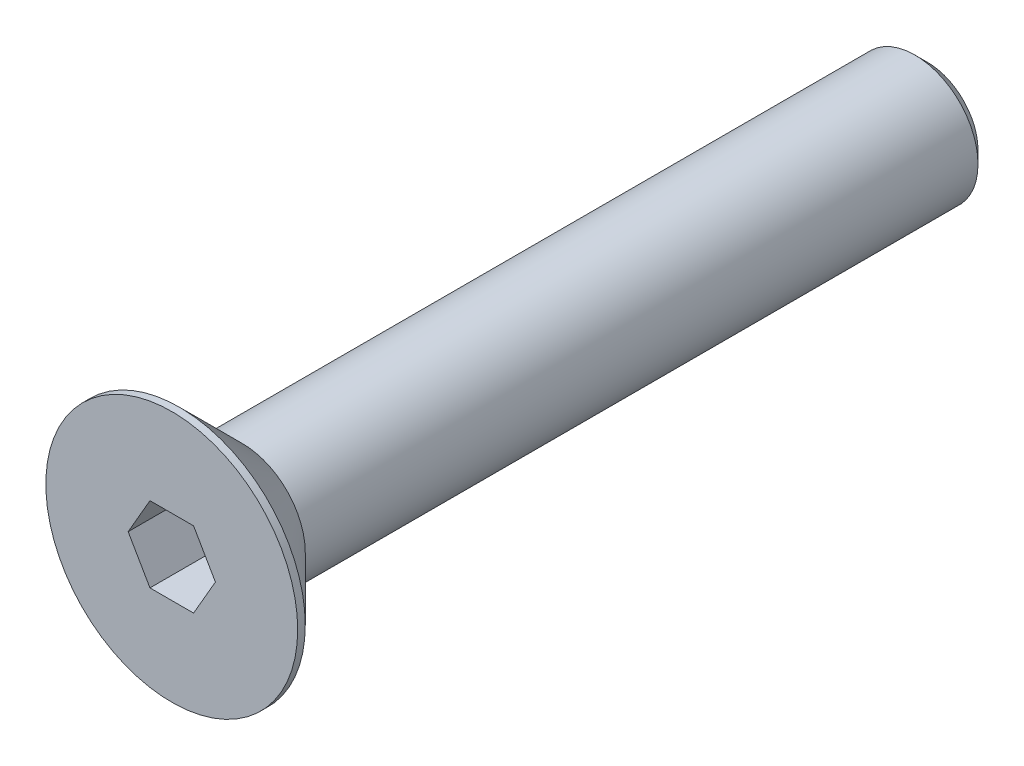
ISO-10303-21;
HEADER;
FILE_DESCRIPTION(('STEP AP214'),'2;1');
FILE_NAME('part.step','',(''),(''),'','','');
FILE_SCHEMA(('AUTOMOTIVE_DESIGN { 1 0 10303 214 1 1 1 1 }'));
ENDSEC;
DATA;
#1=APPLICATION_CONTEXT('core data for automotive mechanical design processes');
#2=APPLICATION_PROTOCOL_DEFINITION('international standard','automotive_design',2000,#1);
#3=PRODUCT_CONTEXT('',#1,'mechanical');
#4=PRODUCT('Part','Part','',(#3));
#5=PRODUCT_RELATED_PRODUCT_CATEGORY('part','',(#4));
#6=PRODUCT_DEFINITION_FORMATION('','',#4);
#7=PRODUCT_DEFINITION_CONTEXT('part definition',#1,'design');
#8=PRODUCT_DEFINITION('design','',#6,#7);
#9=PRODUCT_DEFINITION_SHAPE('','',#8);
#10=(LENGTH_UNIT() NAMED_UNIT(*) SI_UNIT(.MILLI.,.METRE.));
#11=(NAMED_UNIT(*) PLANE_ANGLE_UNIT() SI_UNIT($,.RADIAN.));
#12=(NAMED_UNIT(*) SI_UNIT($,.STERADIAN.) SOLID_ANGLE_UNIT());
#13=UNCERTAINTY_MEASURE_WITH_UNIT(LENGTH_MEASURE(1.E-05),#10,'distance_accuracy_value','');
#14=(GEOMETRIC_REPRESENTATION_CONTEXT(3) GLOBAL_UNCERTAINTY_ASSIGNED_CONTEXT((#13)) GLOBAL_UNIT_ASSIGNED_CONTEXT((#10,
#11,#12)) REPRESENTATION_CONTEXT('',''));
#15=CARTESIAN_POINT('',(0.,0.,0.));
#16=DIRECTION('',(0.,0.,1.));
#17=DIRECTION('',(1.,0.,0.));
#18=AXIS2_PLACEMENT_3D('',#15,#16,#17);
#19=CARTESIAN_POINT('',(0.,0.,2.8));
#20=DIRECTION('',(0.,0.,1.));
#21=DIRECTION('',(-1.,0.,0.));
#22=AXIS2_PLACEMENT_3D('',#19,#20,#21);
#23=PLANE('',#22);
#24=CARTESIAN_POINT('',(0.,0.,2.8));
#25=DIRECTION('',(0.,0.,1.));
#26=DIRECTION('',(1.,0.,0.));
#27=AXIS2_PLACEMENT_3D('',#24,#25,#26);
#28=CIRCLE('',#27,5.);
#29=CARTESIAN_POINT('',(5.,0.,2.8));
#30=VERTEX_POINT('',#29);
#31=EDGE_CURVE('E11',#30,#30,#28,.T.);
#32=ORIENTED_EDGE('',*,*,#31,.T.);
#33=EDGE_LOOP('',(#32));
#34=FACE_BOUND('',#33,.T.);
#35=DIRECTION('',(-1.,0.,0.));
#36=VECTOR('',#35,1.);
#37=CARTESIAN_POINT('',(0.216506350949999,-1.5,2.8));
#38=LINE('',#37,#36);
#39=CARTESIAN_POINT('',(0.8660254038,-1.5,2.8));
#40=VERTEX_POINT('',#39);
#41=CARTESIAN_POINT('',(-0.8660254038,-1.5,2.8));
#42=VERTEX_POINT('',#41);
#43=EDGE_CURVE('E76',#40,#42,#38,.T.);
#44=ORIENTED_EDGE('',*,*,#43,.T.);
#45=DIRECTION('',(-0.500000000006738,0.866025403780548,0.));
#46=VECTOR('',#45,1.);
#47=CARTESIAN_POINT('',(-1.29903810569416,-0.750000000010107,2.8));
#48=LINE('',#47,#46);
#49=CARTESIAN_POINT('',(-1.7320508076,0.,2.8));
#50=VERTEX_POINT('',#49);
#51=EDGE_CURVE('E110',#42,#50,#48,.T.);
#52=ORIENTED_EDGE('',*,*,#51,.T.);
#53=DIRECTION('',(0.500000000006738,0.866025403780548,0.));
#54=VECTOR('',#53,1.);
#55=CARTESIAN_POINT('',(-1.29903810569416,0.750000000010108,2.8));
#56=LINE('',#55,#54);
#57=CARTESIAN_POINT('',(-0.8660254038,1.5,2.8));
#58=VERTEX_POINT('',#57);
#59=EDGE_CURVE('E120',#50,#58,#56,.T.);
#60=ORIENTED_EDGE('',*,*,#59,.T.);
#61=DIRECTION('',(1.,0.,0.));
#62=VECTOR('',#61,1.);
#63=CARTESIAN_POINT('',(0.,1.5,2.8));
#64=LINE('',#63,#62);
#65=CARTESIAN_POINT('',(0.8660254038,1.5,2.8));
#66=VERTEX_POINT('',#65);
#67=EDGE_CURVE('E114',#58,#66,#64,.T.);
#68=ORIENTED_EDGE('',*,*,#67,.T.);
#69=DIRECTION('',(0.500000000006738,-0.866025403780548,0.));
#70=VECTOR('',#69,1.);
#71=CARTESIAN_POINT('',(1.29903810569416,0.750000000010107,2.8));
#72=LINE('',#71,#70);
#73=CARTESIAN_POINT('',(1.7320508076,0.,2.8));
#74=VERTEX_POINT('',#73);
#75=EDGE_CURVE('E97',#66,#74,#72,.T.);
#76=ORIENTED_EDGE('',*,*,#75,.T.);
#77=DIRECTION('',(-0.500000000006738,-0.866025403780548,0.));
#78=VECTOR('',#77,1.);
#79=CARTESIAN_POINT('',(1.29903810569416,-0.750000000010108,2.8));
#80=LINE('',#79,#78);
#81=EDGE_CURVE('E91',#74,#40,#80,.T.);
#82=ORIENTED_EDGE('',*,*,#81,.T.);
#83=EDGE_LOOP('',(#44,#52,#60,#68,#76,#82));
#84=FACE_BOUND('',#83,.T.);
#85=ADVANCED_FACE('F16',(#34,#84),#23,.T.);
#86=CARTESIAN_POINT('',(0.,0.,1.4));
#87=DIRECTION('',(0.,0.,1.));
#88=DIRECTION('',(1.,0.,0.));
#89=AXIS2_PLACEMENT_3D('',#86,#87,#88);
#90=CYLINDRICAL_SURFACE('',#89,5.);
#91=ORIENTED_EDGE('',*,*,#31,.F.);
#92=EDGE_LOOP('',(#91));
#93=FACE_BOUND('',#92,.T.);
#94=CARTESIAN_POINT('',(0.,0.,2.5));
#95=DIRECTION('',(0.,0.,1.));
#96=DIRECTION('',(1.,0.,0.));
#97=AXIS2_PLACEMENT_3D('',#94,#95,#96);
#98=CIRCLE('',#97,5.);
#99=CARTESIAN_POINT('',(5.,0.,2.5));
#100=VERTEX_POINT('',#99);
#101=EDGE_CURVE('E24',#100,#100,#98,.T.);
#102=ORIENTED_EDGE('',*,*,#101,.T.);
#103=EDGE_LOOP('',(#102));
#104=FACE_BOUND('',#103,.T.);
#105=ADVANCED_FACE('F166',(#93,#104),#90,.T.);
#106=CARTESIAN_POINT('',(0.,0.,1.25));
#107=DIRECTION('',(0.,0.,1.));
#108=DIRECTION('',(1.,0.,0.));
#109=AXIS2_PLACEMENT_3D('',#106,#107,#108);
#110=CONICAL_SURFACE('',#109,3.75,0.785398163397448);
#111=CARTESIAN_POINT('',(0.,0.,0.));
#112=DIRECTION('',(0.,0.,-1.));
#113=DIRECTION('',(1.,0.,0.));
#114=AXIS2_PLACEMENT_3D('',#111,#112,#113);
#115=CIRCLE('',#114,2.5);
#116=CARTESIAN_POINT('',(2.5,0.,0.));
#117=VERTEX_POINT('',#116);
#118=EDGE_CURVE('E105',#117,#117,#115,.T.);
#119=ORIENTED_EDGE('',*,*,#118,.F.);
#120=EDGE_LOOP('',(#119));
#121=FACE_BOUND('',#120,.T.);
#122=ORIENTED_EDGE('',*,*,#101,.F.);
#123=EDGE_LOOP('',(#122));
#124=FACE_BOUND('',#123,.T.);
#125=ADVANCED_FACE('F170',(#121,#124),#110,.T.);
#126=CARTESIAN_POINT('',(0.,0.,-27.2));
#127=DIRECTION('',(0.,0.,-1.));
#128=DIRECTION('',(1.,0.,0.));
#129=AXIS2_PLACEMENT_3D('',#126,#127,#128);
#130=PLANE('',#129);
#131=CARTESIAN_POINT('',(0.,0.,-27.2));
#132=DIRECTION('',(0.,0.,-1.));
#133=DIRECTION('',(1.,0.,0.));
#134=AXIS2_PLACEMENT_3D('',#131,#132,#133);
#135=CIRCLE('',#134,2.00925);
#136=CARTESIAN_POINT('',(2.00925,0.,-27.2));
#137=VERTEX_POINT('',#136);
#138=EDGE_CURVE('E123',#137,#137,#135,.T.);
#139=ORIENTED_EDGE('',*,*,#138,.T.);
#140=EDGE_LOOP('',(#139));
#141=FACE_BOUND('',#140,.T.);
#142=ADVANCED_FACE('F176',(#141),#130,.T.);
#143=CARTESIAN_POINT('',(0.,0.,-12.2));
#144=DIRECTION('',(0.,0.,1.));
#145=DIRECTION('',(1.,0.,0.));
#146=AXIS2_PLACEMENT_3D('',#143,#144,#145);
#147=CYLINDRICAL_SURFACE('',#146,2.5);
#148=ORIENTED_EDGE('',*,*,#118,.T.);
#149=EDGE_LOOP('',(#148));
#150=FACE_BOUND('',#149,.T.);
#151=CARTESIAN_POINT('',(0.,0.,-26.70925));
#152=DIRECTION('',(0.,0.,1.));
#153=DIRECTION('',(1.,0.,0.));
#154=AXIS2_PLACEMENT_3D('',#151,#152,#153);
#155=CIRCLE('',#154,2.5);
#156=CARTESIAN_POINT('',(2.5,0.,-26.70925));
#157=VERTEX_POINT('',#156);
#158=EDGE_CURVE('E118',#157,#157,#155,.T.);
#159=ORIENTED_EDGE('',*,*,#158,.T.);
#160=EDGE_LOOP('',(#159));
#161=FACE_BOUND('',#160,.T.);
#162=ADVANCED_FACE('F192',(#150,#161),#147,.T.);
#163=CARTESIAN_POINT('',(0.,0.,-26.954625));
#164=DIRECTION('',(0.,0.,1.));
#165=DIRECTION('',(1.,0.,0.));
#166=AXIS2_PLACEMENT_3D('',#163,#164,#165);
#167=CONICAL_SURFACE('',#166,2.254625,0.78539816339745);
#168=ORIENTED_EDGE('',*,*,#138,.F.);
#169=EDGE_LOOP('',(#168));
#170=FACE_BOUND('',#169,.T.);
#171=ORIENTED_EDGE('',*,*,#158,.F.);
#172=EDGE_LOOP('',(#171));
#173=FACE_BOUND('',#172,.T.);
#174=ADVANCED_FACE('F187',(#170,#173),#167,.T.);
#175=CARTESIAN_POINT('',(0.,0.,0.5));
#176=DIRECTION('',(0.,0.,-1.));
#177=DIRECTION('',(0.,-1.,0.));
#178=AXIS2_PLACEMENT_3D('',#175,#176,#177);
#179=PLANE('',#178);
#180=DIRECTION('',(1.,0.,0.));
#181=VECTOR('',#180,1.);
#182=CARTESIAN_POINT('',(0.,-1.5,0.5));
#183=LINE('',#182,#181);
#184=CARTESIAN_POINT('',(-0.866025403800001,-1.5,0.5));
#185=VERTEX_POINT('',#184);
#186=CARTESIAN_POINT('',(0.866025403799999,-1.5,0.5));
#187=VERTEX_POINT('',#186);
#188=EDGE_CURVE('E86',#185,#187,#183,.T.);
#189=ORIENTED_EDGE('',*,*,#188,.T.);
#190=DIRECTION('',(0.500000000006738,0.866025403780548,0.));
#191=VECTOR('',#190,1.);
#192=CARTESIAN_POINT('',(1.7320508076,0.,0.5));
#193=LINE('',#192,#191);
#194=CARTESIAN_POINT('',(1.7320508076,0.,0.5));
#195=VERTEX_POINT('',#194);
#196=EDGE_CURVE('E93',#187,#195,#193,.T.);
#197=ORIENTED_EDGE('',*,*,#196,.T.);
#198=DIRECTION('',(-0.500000000006738,0.866025403780549,0.));
#199=VECTOR('',#198,1.);
#200=CARTESIAN_POINT('',(0.8660254038,1.5,0.5));
#201=LINE('',#200,#199);
#202=CARTESIAN_POINT('',(0.8660254038,1.5,0.5));
#203=VERTEX_POINT('',#202);
#204=EDGE_CURVE('E101',#195,#203,#201,.T.);
#205=ORIENTED_EDGE('',*,*,#204,.T.);
#206=DIRECTION('',(-1.,0.,0.));
#207=VECTOR('',#206,1.);
#208=CARTESIAN_POINT('',(-0.8660254038,1.5,0.5));
#209=LINE('',#208,#207);
#210=CARTESIAN_POINT('',(-0.8660254038,1.5,0.5));
#211=VERTEX_POINT('',#210);
#212=EDGE_CURVE('E109',#203,#211,#209,.T.);
#213=ORIENTED_EDGE('',*,*,#212,.T.);
#214=DIRECTION('',(-0.500000000006738,-0.866025403780548,0.));
#215=VECTOR('',#214,1.);
#216=CARTESIAN_POINT('',(-1.7320508076,0.,0.5));
#217=LINE('',#216,#215);
#218=CARTESIAN_POINT('',(-1.7320508076,0.,0.5));
#219=VERTEX_POINT('',#218);
#220=EDGE_CURVE('E113',#211,#219,#217,.T.);
#221=ORIENTED_EDGE('',*,*,#220,.T.);
#222=DIRECTION('',(0.500000000006738,-0.866025403780549,0.));
#223=VECTOR('',#222,1.);
#224=CARTESIAN_POINT('',(-0.866025403800001,-1.5,0.5));
#225=LINE('',#224,#223);
#226=EDGE_CURVE('E112',#219,#185,#225,.T.);
#227=ORIENTED_EDGE('',*,*,#226,.T.);
#228=EDGE_LOOP('',(#189,#197,#205,#213,#221,#227));
#229=FACE_BOUND('',#228,.T.);
#230=ADVANCED_FACE('F137',(#229),#179,.F.);
#231=CARTESIAN_POINT('',(-1.2990381057,-0.75,3.8));
#232=DIRECTION('',(-0.866025403780548,-0.500000000006738,0.));
#233=DIRECTION('',(-0.500000000006738,0.866025403780548,0.));
#234=AXIS2_PLACEMENT_3D('',#231,#232,#233);
#235=PLANE('',#234);
#236=ORIENTED_EDGE('',*,*,#51,.F.);
#237=DIRECTION('',(0.,0.,-1.));
#238=VECTOR('',#237,1.);
#239=CARTESIAN_POINT('',(-0.8660254038,-1.5,3.8));
#240=LINE('',#239,#238);
#241=EDGE_CURVE('E83',#42,#185,#240,.T.);
#242=ORIENTED_EDGE('',*,*,#241,.T.);
#243=ORIENTED_EDGE('',*,*,#226,.F.);
#244=DIRECTION('',(0.,0.,-1.));
#245=VECTOR('',#244,1.);
#246=CARTESIAN_POINT('',(-1.7320508076,0.,3.8));
#247=LINE('',#246,#245);
#248=EDGE_CURVE('E122',#50,#219,#247,.T.);
#249=ORIENTED_EDGE('',*,*,#248,.F.);
#250=EDGE_LOOP('',(#236,#242,#243,#249));
#251=FACE_BOUND('',#250,.T.);
#252=ADVANCED_FACE('F151',(#251),#235,.F.);
#253=CARTESIAN_POINT('',(-1.2990381057,0.75,3.8));
#254=DIRECTION('',(-0.866025403780548,0.500000000006739,0.));
#255=DIRECTION('',(0.500000000006739,0.866025403780548,0.));
#256=AXIS2_PLACEMENT_3D('',#253,#254,#255);
#257=PLANE('',#256);
#258=ORIENTED_EDGE('',*,*,#59,.F.);
#259=ORIENTED_EDGE('',*,*,#248,.T.);
#260=ORIENTED_EDGE('',*,*,#220,.F.);
#261=DIRECTION('',(0.,0.,-1.));
#262=VECTOR('',#261,1.);
#263=CARTESIAN_POINT('',(-0.8660254038,1.5,3.8));
#264=LINE('',#263,#262);
#265=EDGE_CURVE('E116',#58,#211,#264,.T.);
#266=ORIENTED_EDGE('',*,*,#265,.F.);
#267=EDGE_LOOP('',(#258,#259,#260,#266));
#268=FACE_BOUND('',#267,.T.);
#269=ADVANCED_FACE('F147',(#268),#257,.F.);
#270=CARTESIAN_POINT('',(0.4330127019,-1.5,3.8));
#271=DIRECTION('',(0.,-1.,0.));
#272=DIRECTION('',(-1.,0.,0.));
#273=AXIS2_PLACEMENT_3D('',#270,#271,#272);
#274=PLANE('',#273);
#275=ORIENTED_EDGE('',*,*,#43,.F.);
#276=DIRECTION('',(0.,0.,-1.));
#277=VECTOR('',#276,1.);
#278=CARTESIAN_POINT('',(0.8660254038,-1.5,3.8));
#279=LINE('',#278,#277);
#280=EDGE_CURVE('E80',#40,#187,#279,.T.);
#281=ORIENTED_EDGE('',*,*,#280,.T.);
#282=ORIENTED_EDGE('',*,*,#188,.F.);
#283=ORIENTED_EDGE('',*,*,#241,.F.);
#284=EDGE_LOOP('',(#275,#281,#282,#283));
#285=FACE_BOUND('',#284,.T.);
#286=ADVANCED_FACE('F78',(#285),#274,.F.);
#287=CARTESIAN_POINT('',(1.2990381057,-0.75,3.8));
#288=DIRECTION('',(0.866025403780548,-0.500000000006739,0.));
#289=DIRECTION('',(-0.500000000006739,-0.866025403780548,0.));
#290=AXIS2_PLACEMENT_3D('',#287,#288,#289);
#291=PLANE('',#290);
#292=ORIENTED_EDGE('',*,*,#81,.F.);
#293=DIRECTION('',(0.,0.,-1.));
#294=VECTOR('',#293,1.);
#295=CARTESIAN_POINT('',(1.7320508076,0.,3.8));
#296=LINE('',#295,#294);
#297=EDGE_CURVE('E98',#74,#195,#296,.T.);
#298=ORIENTED_EDGE('',*,*,#297,.T.);
#299=ORIENTED_EDGE('',*,*,#196,.F.);
#300=ORIENTED_EDGE('',*,*,#280,.F.);
#301=EDGE_LOOP('',(#292,#298,#299,#300));
#302=FACE_BOUND('',#301,.T.);
#303=ADVANCED_FACE('F89',(#302),#291,.F.);
#304=CARTESIAN_POINT('',(1.2990381057,0.75,3.8));
#305=DIRECTION('',(0.866025403780548,0.500000000006738,0.));
#306=DIRECTION('',(0.500000000006738,-0.866025403780548,0.));
#307=AXIS2_PLACEMENT_3D('',#304,#305,#306);
#308=PLANE('',#307);
#309=ORIENTED_EDGE('',*,*,#75,.F.);
#310=DIRECTION('',(0.,0.,-1.));
#311=VECTOR('',#310,1.);
#312=CARTESIAN_POINT('',(0.8660254038,1.5,3.8));
#313=LINE('',#312,#311);
#314=EDGE_CURVE('E106',#66,#203,#313,.T.);
#315=ORIENTED_EDGE('',*,*,#314,.T.);
#316=ORIENTED_EDGE('',*,*,#204,.F.);
#317=ORIENTED_EDGE('',*,*,#297,.F.);
#318=EDGE_LOOP('',(#309,#315,#316,#317));
#319=FACE_BOUND('',#318,.T.);
#320=ADVANCED_FACE('F153',(#319),#308,.F.);
#321=CARTESIAN_POINT('',(0.,1.5,3.8));
#322=DIRECTION('',(0.,1.,0.));
#323=DIRECTION('',(1.,0.,0.));
#324=AXIS2_PLACEMENT_3D('',#321,#322,#323);
#325=PLANE('',#324);
#326=ORIENTED_EDGE('',*,*,#67,.F.);
#327=ORIENTED_EDGE('',*,*,#265,.T.);
#328=ORIENTED_EDGE('',*,*,#212,.F.);
#329=ORIENTED_EDGE('',*,*,#314,.F.);
#330=EDGE_LOOP('',(#326,#327,#328,#329));
#331=FACE_BOUND('',#330,.T.);
#332=ADVANCED_FACE('F144',(#331),#325,.F.);
#333=CLOSED_SHELL('',(#85,#105,#125,#142,#162,#174,#230,#252,#269,#286,#303,#320,#332));
#334=MANIFOLD_SOLID_BREP('B1',#333);
#335=ADVANCED_BREP_SHAPE_REPRESENTATION('',(#18,#334),#14);
#336=SHAPE_DEFINITION_REPRESENTATION(#9,#335);
ENDSEC;
END-ISO-10303-21;
